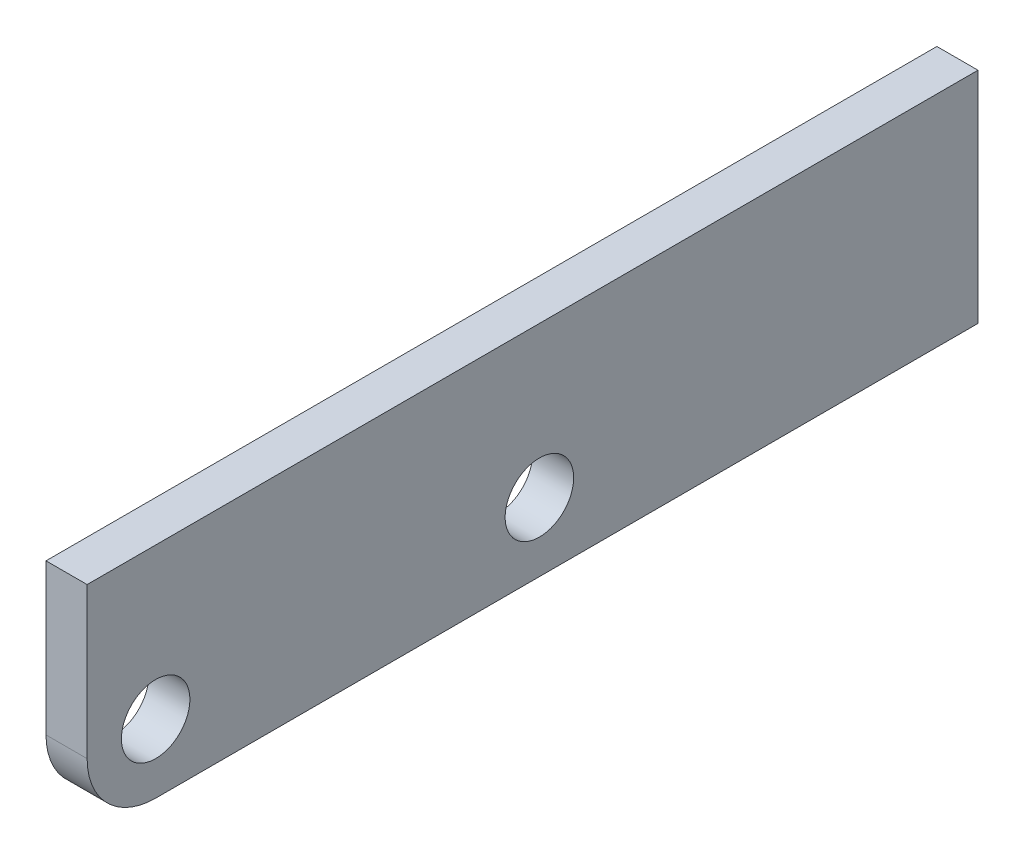
ISO-10303-21;
HEADER;
FILE_DESCRIPTION(('STEP AP214'),'2;1');
FILE_NAME('part.step','',(''),(''),'','','');
FILE_SCHEMA(('AUTOMOTIVE_DESIGN { 1 0 10303 214 1 1 1 1 }'));
ENDSEC;
DATA;
#1=APPLICATION_CONTEXT('core data for automotive mechanical design processes');
#2=APPLICATION_PROTOCOL_DEFINITION('international standard','automotive_design',2000,#1);
#3=PRODUCT_CONTEXT('',#1,'mechanical');
#4=PRODUCT('Part','Part','',(#3));
#5=PRODUCT_RELATED_PRODUCT_CATEGORY('part','',(#4));
#6=PRODUCT_DEFINITION_FORMATION('','',#4);
#7=PRODUCT_DEFINITION_CONTEXT('part definition',#1,'design');
#8=PRODUCT_DEFINITION('design','',#6,#7);
#9=PRODUCT_DEFINITION_SHAPE('','',#8);
#10=(LENGTH_UNIT() NAMED_UNIT(*) SI_UNIT(.MILLI.,.METRE.));
#11=(NAMED_UNIT(*) PLANE_ANGLE_UNIT() SI_UNIT($,.RADIAN.));
#12=(NAMED_UNIT(*) SI_UNIT($,.STERADIAN.) SOLID_ANGLE_UNIT());
#13=UNCERTAINTY_MEASURE_WITH_UNIT(LENGTH_MEASURE(1.E-05),#10,'distance_accuracy_value','');
#14=(GEOMETRIC_REPRESENTATION_CONTEXT(3) GLOBAL_UNCERTAINTY_ASSIGNED_CONTEXT((#13)) GLOBAL_UNIT_ASSIGNED_CONTEXT((#10,
#11,#12)) REPRESENTATION_CONTEXT('',''));
#15=CARTESIAN_POINT('',(0.,0.,0.));
#16=DIRECTION('',(0.,0.,1.));
#17=DIRECTION('',(1.,0.,0.));
#18=AXIS2_PLACEMENT_3D('',#15,#16,#17);
#19=CARTESIAN_POINT('',(9.525,50.8,-206.375));
#20=DIRECTION('',(0.,0.,1.));
#21=DIRECTION('',(1.,0.,0.));
#22=AXIS2_PLACEMENT_3D('',#19,#20,#21);
#23=PLANE('',#22);
#24=DIRECTION('',(0.,1.,0.));
#25=VECTOR('',#24,1.);
#26=CARTESIAN_POINT('',(-9.525,50.8,-206.375));
#27=LINE('',#26,#25);
#28=CARTESIAN_POINT('',(-9.525,-50.8,-206.375));
#29=VERTEX_POINT('',#28);
#30=CARTESIAN_POINT('',(-9.525,50.8,-206.375));
#31=VERTEX_POINT('',#30);
#32=EDGE_CURVE('E102',#29,#31,#27,.T.);
#33=ORIENTED_EDGE('',*,*,#32,.T.);
#34=DIRECTION('',(-1.,0.,0.));
#35=VECTOR('',#34,1.);
#36=CARTESIAN_POINT('',(9.525,50.8,-206.375));
#37=LINE('',#36,#35);
#38=CARTESIAN_POINT('',(9.525,50.8,-206.375));
#39=VERTEX_POINT('',#38);
#40=EDGE_CURVE('E84',#39,#31,#37,.T.);
#41=ORIENTED_EDGE('',*,*,#40,.F.);
#42=DIRECTION('',(0.,1.,0.));
#43=VECTOR('',#42,1.);
#44=CARTESIAN_POINT('',(9.525,50.8,-206.375));
#45=LINE('',#44,#43);
#46=CARTESIAN_POINT('',(9.525,-50.8,-206.375));
#47=VERTEX_POINT('',#46);
#48=EDGE_CURVE('E90',#47,#39,#45,.T.);
#49=ORIENTED_EDGE('',*,*,#48,.F.);
#50=DIRECTION('',(-1.,0.,0.));
#51=VECTOR('',#50,1.);
#52=CARTESIAN_POINT('',(9.525,-50.8,-206.375));
#53=LINE('',#52,#51);
#54=EDGE_CURVE('E107',#47,#29,#53,.T.);
#55=ORIENTED_EDGE('',*,*,#54,.T.);
#56=EDGE_LOOP('',(#33,#41,#49,#55));
#57=FACE_BOUND('',#56,.T.);
#58=ADVANCED_FACE('F33',(#57),#23,.F.);
#59=CARTESIAN_POINT('',(9.525,50.8,206.375));
#60=DIRECTION('',(0.,-1.,0.));
#61=DIRECTION('',(0.,0.,-1.));
#62=AXIS2_PLACEMENT_3D('',#59,#60,#61);
#63=PLANE('',#62);
#64=DIRECTION('',(0.,0.,1.));
#65=VECTOR('',#64,1.);
#66=CARTESIAN_POINT('',(-9.525,50.8,206.375));
#67=LINE('',#66,#65);
#68=CARTESIAN_POINT('',(-9.525,50.8,206.375));
#69=VERTEX_POINT('',#68);
#70=EDGE_CURVE('E115',#31,#69,#67,.T.);
#71=ORIENTED_EDGE('',*,*,#70,.T.);
#72=DIRECTION('',(-1.,0.,0.));
#73=VECTOR('',#72,1.);
#74=CARTESIAN_POINT('',(9.525,50.8,206.375));
#75=LINE('',#74,#73);
#76=CARTESIAN_POINT('',(9.525,50.8,206.375));
#77=VERTEX_POINT('',#76);
#78=EDGE_CURVE('E87',#77,#69,#75,.T.);
#79=ORIENTED_EDGE('',*,*,#78,.F.);
#80=DIRECTION('',(0.,0.,1.));
#81=VECTOR('',#80,1.);
#82=CARTESIAN_POINT('',(9.525,50.8,206.375));
#83=LINE('',#82,#81);
#84=EDGE_CURVE('E80',#39,#77,#83,.T.);
#85=ORIENTED_EDGE('',*,*,#84,.F.);
#86=ORIENTED_EDGE('',*,*,#40,.T.);
#87=EDGE_LOOP('',(#71,#79,#85,#86));
#88=FACE_BOUND('',#87,.T.);
#89=ADVANCED_FACE('F82',(#88),#63,.F.);
#90=CARTESIAN_POINT('',(9.525,50.8,206.375));
#91=DIRECTION('',(0.,0.,-1.));
#92=DIRECTION('',(-1.,0.,0.));
#93=AXIS2_PLACEMENT_3D('',#90,#91,#92);
#94=PLANE('',#93);
#95=DIRECTION('',(0.,-1.,0.));
#96=VECTOR('',#95,1.);
#97=CARTESIAN_POINT('',(-9.525,50.8,206.375));
#98=LINE('',#97,#96);
#99=CARTESIAN_POINT('',(-9.525,-19.05,206.375));
#100=VERTEX_POINT('',#99);
#101=EDGE_CURVE('E113',#69,#100,#98,.T.);
#102=ORIENTED_EDGE('',*,*,#101,.T.);
#103=DIRECTION('',(-1.,0.,0.));
#104=VECTOR('',#103,1.);
#105=CARTESIAN_POINT('',(9.525,-19.05,206.375));
#106=LINE('',#105,#104);
#107=CARTESIAN_POINT('',(9.525,-19.05,206.375));
#108=VERTEX_POINT('',#107);
#109=EDGE_CURVE('E41',#100,#108,#106,.F.);
#110=ORIENTED_EDGE('',*,*,#109,.T.);
#111=DIRECTION('',(0.,-1.,0.));
#112=VECTOR('',#111,1.);
#113=CARTESIAN_POINT('',(9.525,50.8,206.375));
#114=LINE('',#113,#112);
#115=EDGE_CURVE('E89',#77,#108,#114,.T.);
#116=ORIENTED_EDGE('',*,*,#115,.F.);
#117=ORIENTED_EDGE('',*,*,#78,.T.);
#118=EDGE_LOOP('',(#102,#110,#116,#117));
#119=FACE_BOUND('',#118,.T.);
#120=ADVANCED_FACE('F156',(#119),#94,.F.);
#121=CARTESIAN_POINT('',(9.525,-50.8,206.375));
#122=DIRECTION('',(0.,1.,0.));
#123=DIRECTION('',(0.,0.,1.));
#124=AXIS2_PLACEMENT_3D('',#121,#122,#123);
#125=PLANE('',#124);
#126=DIRECTION('',(0.,0.,-1.));
#127=VECTOR('',#126,1.);
#128=CARTESIAN_POINT('',(9.525,-50.8,206.375));
#129=LINE('',#128,#127);
#130=CARTESIAN_POINT('',(9.525,-50.8,174.625));
#131=VERTEX_POINT('',#130);
#132=EDGE_CURVE('E95',#131,#47,#129,.T.);
#133=ORIENTED_EDGE('',*,*,#132,.F.);
#134=DIRECTION('',(-1.,0.,0.));
#135=VECTOR('',#134,1.);
#136=CARTESIAN_POINT('',(9.525,-50.8,174.625));
#137=LINE('',#136,#135);
#138=CARTESIAN_POINT('',(-9.525,-50.8,174.625));
#139=VERTEX_POINT('',#138);
#140=EDGE_CURVE('E103',#131,#139,#137,.T.);
#141=ORIENTED_EDGE('',*,*,#140,.T.);
#142=DIRECTION('',(0.,0.,-1.));
#143=VECTOR('',#142,1.);
#144=CARTESIAN_POINT('',(-9.525,-50.8,206.375));
#145=LINE('',#144,#143);
#146=EDGE_CURVE('E99',#139,#29,#145,.T.);
#147=ORIENTED_EDGE('',*,*,#146,.T.);
#148=ORIENTED_EDGE('',*,*,#54,.F.);
#149=EDGE_LOOP('',(#133,#141,#147,#148));
#150=FACE_BOUND('',#149,.T.);
#151=ADVANCED_FACE('F139',(#150),#125,.F.);
#152=CARTESIAN_POINT('',(9.525,0.,0.));
#153=DIRECTION('',(1.,0.,0.));
#154=DIRECTION('',(0.,0.,-1.));
#155=AXIS2_PLACEMENT_3D('',#152,#153,#154);
#156=PLANE('',#155);
#157=CARTESIAN_POINT('',(9.525,-19.05,-3.17499999999998));
#158=DIRECTION('',(1.,0.,0.));
#159=DIRECTION('',(0.,0.,-1.));
#160=AXIS2_PLACEMENT_3D('',#157,#158,#159);
#161=CIRCLE('',#160,15.875);
#162=CARTESIAN_POINT('',(9.525,-19.05,-19.05));
#163=VERTEX_POINT('',#162);
#164=EDGE_CURVE('E129',#163,#163,#161,.T.);
#165=ORIENTED_EDGE('',*,*,#164,.F.);
#166=EDGE_LOOP('',(#165));
#167=FACE_BOUND('',#166,.T.);
#168=CARTESIAN_POINT('',(9.525,-19.05,174.625));
#169=DIRECTION('',(1.,0.,0.));
#170=DIRECTION('',(0.,0.,-1.));
#171=AXIS2_PLACEMENT_3D('',#168,#169,#170);
#172=CIRCLE('',#171,15.875);
#173=CARTESIAN_POINT('',(9.525,-19.05,158.75));
#174=VERTEX_POINT('',#173);
#175=EDGE_CURVE('E123',#174,#174,#172,.T.);
#176=ORIENTED_EDGE('',*,*,#175,.F.);
#177=EDGE_LOOP('',(#176));
#178=FACE_BOUND('',#177,.T.);
#179=ORIENTED_EDGE('',*,*,#115,.T.);
#180=CARTESIAN_POINT('',(9.525,-19.05,174.625));
#181=DIRECTION('',(1.,0.,0.));
#182=DIRECTION('',(0.,0.,-1.));
#183=AXIS2_PLACEMENT_3D('',#180,#181,#182);
#184=CIRCLE('',#183,31.75);
#185=EDGE_CURVE('E11',#108,#131,#184,.T.);
#186=ORIENTED_EDGE('',*,*,#185,.T.);
#187=ORIENTED_EDGE('',*,*,#132,.T.);
#188=ORIENTED_EDGE('',*,*,#48,.T.);
#189=ORIENTED_EDGE('',*,*,#84,.T.);
#190=EDGE_LOOP('',(#179,#186,#187,#188,#189));
#191=FACE_BOUND('',#190,.T.);
#192=ADVANCED_FACE('F93',(#167,#178,#191),#156,.T.);
#193=CARTESIAN_POINT('',(-9.525,0.,0.));
#194=DIRECTION('',(1.,0.,0.));
#195=DIRECTION('',(0.,0.,-1.));
#196=AXIS2_PLACEMENT_3D('',#193,#194,#195);
#197=PLANE('',#196);
#198=CARTESIAN_POINT('',(-9.525,-19.05,-3.17499999999998));
#199=DIRECTION('',(1.,0.,0.));
#200=DIRECTION('',(0.,0.,-1.));
#201=AXIS2_PLACEMENT_3D('',#198,#199,#200);
#202=CIRCLE('',#201,15.875);
#203=CARTESIAN_POINT('',(-9.525,-19.05,-19.05));
#204=VERTEX_POINT('',#203);
#205=EDGE_CURVE('E126',#204,#204,#202,.F.);
#206=ORIENTED_EDGE('',*,*,#205,.F.);
#207=EDGE_LOOP('',(#206));
#208=FACE_BOUND('',#207,.T.);
#209=CARTESIAN_POINT('',(-9.525,-19.05,174.625));
#210=DIRECTION('',(1.,0.,0.));
#211=DIRECTION('',(0.,0.,-1.));
#212=AXIS2_PLACEMENT_3D('',#209,#210,#211);
#213=CIRCLE('',#212,15.875);
#214=CARTESIAN_POINT('',(-9.525,-19.05,158.75));
#215=VERTEX_POINT('',#214);
#216=EDGE_CURVE('E118',#215,#215,#213,.F.);
#217=ORIENTED_EDGE('',*,*,#216,.F.);
#218=EDGE_LOOP('',(#217));
#219=FACE_BOUND('',#218,.T.);
#220=ORIENTED_EDGE('',*,*,#146,.F.);
#221=CARTESIAN_POINT('',(-9.525,-19.05,174.625));
#222=DIRECTION('',(1.,0.,0.));
#223=DIRECTION('',(0.,0.,-1.));
#224=AXIS2_PLACEMENT_3D('',#221,#222,#223);
#225=CIRCLE('',#224,31.75);
#226=EDGE_CURVE('E55',#139,#100,#225,.F.);
#227=ORIENTED_EDGE('',*,*,#226,.T.);
#228=ORIENTED_EDGE('',*,*,#101,.F.);
#229=ORIENTED_EDGE('',*,*,#70,.F.);
#230=ORIENTED_EDGE('',*,*,#32,.F.);
#231=EDGE_LOOP('',(#220,#227,#228,#229,#230));
#232=FACE_BOUND('',#231,.T.);
#233=ADVANCED_FACE('F138',(#208,#219,#232),#197,.F.);
#234=CARTESIAN_POINT('',(-9.526,-19.05,174.625));
#235=DIRECTION('',(1.,0.,0.));
#236=DIRECTION('',(0.,0.,-1.));
#237=AXIS2_PLACEMENT_3D('',#234,#235,#236);
#238=CYLINDRICAL_SURFACE('',#237,15.875);
#239=ORIENTED_EDGE('',*,*,#175,.T.);
#240=EDGE_LOOP('',(#239));
#241=FACE_BOUND('',#240,.T.);
#242=ORIENTED_EDGE('',*,*,#216,.T.);
#243=EDGE_LOOP('',(#242));
#244=FACE_BOUND('',#243,.T.);
#245=ADVANCED_FACE('F143',(#241,#244),#238,.F.);
#246=CARTESIAN_POINT('',(-9.526,-19.05,-3.17499999999998));
#247=DIRECTION('',(1.,0.,0.));
#248=DIRECTION('',(0.,0.,-1.));
#249=AXIS2_PLACEMENT_3D('',#246,#247,#248);
#250=CYLINDRICAL_SURFACE('',#249,15.875);
#251=ORIENTED_EDGE('',*,*,#164,.T.);
#252=EDGE_LOOP('',(#251));
#253=FACE_BOUND('',#252,.T.);
#254=ORIENTED_EDGE('',*,*,#205,.T.);
#255=EDGE_LOOP('',(#254));
#256=FACE_BOUND('',#255,.T.);
#257=ADVANCED_FACE('F133',(#253,#256),#250,.F.);
#258=CARTESIAN_POINT('',(9.525,-19.05,174.625));
#259=DIRECTION('',(-1.,0.,0.));
#260=DIRECTION('',(0.,0.,1.));
#261=AXIS2_PLACEMENT_3D('',#258,#259,#260);
#262=CYLINDRICAL_SURFACE('',#261,31.75);
#263=ORIENTED_EDGE('',*,*,#185,.F.);
#264=ORIENTED_EDGE('',*,*,#109,.F.);
#265=ORIENTED_EDGE('',*,*,#226,.F.);
#266=ORIENTED_EDGE('',*,*,#140,.F.);
#267=EDGE_LOOP('',(#263,#264,#265,#266));
#268=FACE_BOUND('',#267,.T.);
#269=ADVANCED_FACE('F35',(#268),#262,.T.);
#270=CLOSED_SHELL('',(#58,#89,#120,#151,#192,#233,#245,#257,#269));
#271=MANIFOLD_SOLID_BREP('B2',#270);
#272=ADVANCED_BREP_SHAPE_REPRESENTATION('',(#18,#271),#14);
#273=SHAPE_DEFINITION_REPRESENTATION(#9,#272);
ENDSEC;
END-ISO-10303-21;
